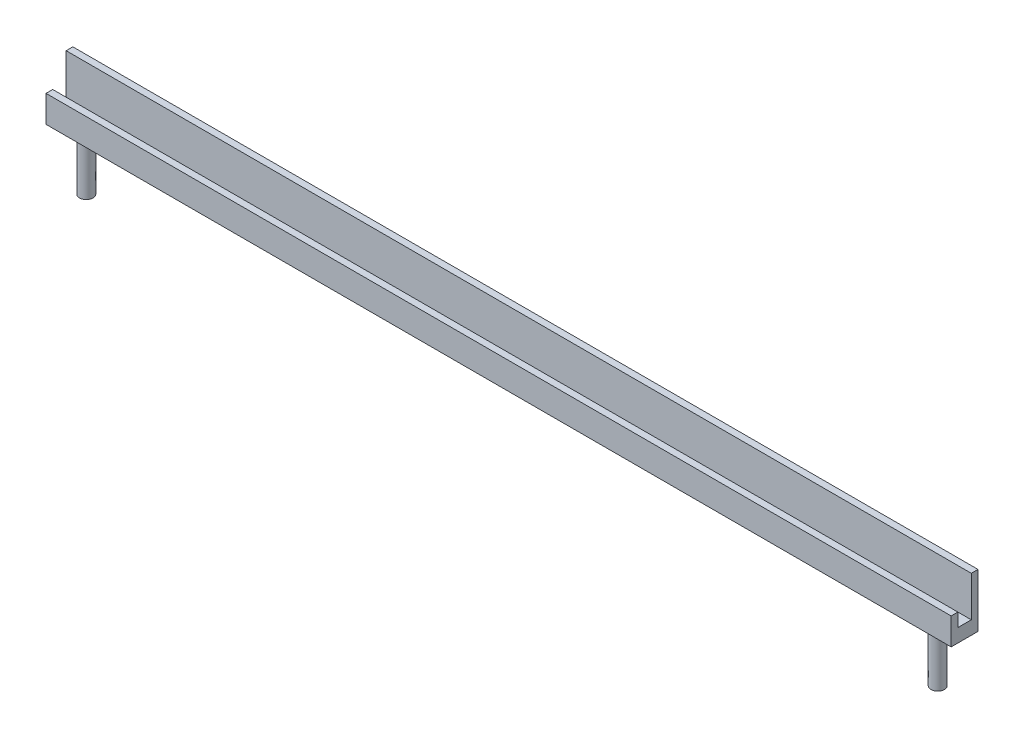
ISO-10303-21;
HEADER;
FILE_DESCRIPTION(('STEP AP214'),'2;1');
FILE_NAME('part.step','',(''),(''),'','','');
FILE_SCHEMA(('AUTOMOTIVE_DESIGN { 1 0 10303 214 1 1 1 1 }'));
ENDSEC;
DATA;
#1=APPLICATION_CONTEXT('core data for automotive mechanical design processes');
#2=APPLICATION_PROTOCOL_DEFINITION('international standard','automotive_design',2000,#1);
#3=PRODUCT_CONTEXT('',#1,'mechanical');
#4=PRODUCT('Part','Part','',(#3));
#5=PRODUCT_RELATED_PRODUCT_CATEGORY('part','',(#4));
#6=PRODUCT_DEFINITION_FORMATION('','',#4);
#7=PRODUCT_DEFINITION_CONTEXT('part definition',#1,'design');
#8=PRODUCT_DEFINITION('design','',#6,#7);
#9=PRODUCT_DEFINITION_SHAPE('','',#8);
#10=(LENGTH_UNIT() NAMED_UNIT(*) SI_UNIT(.MILLI.,.METRE.));
#11=(NAMED_UNIT(*) PLANE_ANGLE_UNIT() SI_UNIT($,.RADIAN.));
#12=(NAMED_UNIT(*) SI_UNIT($,.STERADIAN.) SOLID_ANGLE_UNIT());
#13=UNCERTAINTY_MEASURE_WITH_UNIT(LENGTH_MEASURE(1.E-05),#10,'distance_accuracy_value','');
#14=(GEOMETRIC_REPRESENTATION_CONTEXT(3) GLOBAL_UNCERTAINTY_ASSIGNED_CONTEXT((#13)) GLOBAL_UNIT_ASSIGNED_CONTEXT((#10,
#11,#12)) REPRESENTATION_CONTEXT('',''));
#15=CARTESIAN_POINT('',(0.,0.,0.));
#16=DIRECTION('',(0.,0.,1.));
#17=DIRECTION('',(1.,0.,0.));
#18=AXIS2_PLACEMENT_3D('',#15,#16,#17);
#19=CARTESIAN_POINT('',(0.,0.,0.));
#20=DIRECTION('',(0.,1.,0.));
#21=DIRECTION('',(0.,0.,1.));
#22=AXIS2_PLACEMENT_3D('',#19,#20,#21);
#23=PLANE('',#22);
#24=CARTESIAN_POINT('',(-158.5,0.,0.));
#25=DIRECTION('',(0.,1.,0.));
#26=DIRECTION('',(0.,0.,1.));
#27=AXIS2_PLACEMENT_3D('',#24,#25,#26);
#28=CIRCLE('',#27,2.5);
#29=CARTESIAN_POINT('',(-158.5,0.,2.5));
#30=VERTEX_POINT('',#29);
#31=EDGE_CURVE('E40',#30,#30,#28,.F.);
#32=ORIENTED_EDGE('',*,*,#31,.F.);
#33=EDGE_LOOP('',(#32));
#34=FACE_BOUND('',#33,.T.);
#35=DIRECTION('',(0.,0.,-1.));
#36=VECTOR('',#35,1.);
#37=CARTESIAN_POINT('',(168.5,0.,-5.));
#38=LINE('',#37,#36);
#39=CARTESIAN_POINT('',(168.5,0.,5.));
#40=VERTEX_POINT('',#39);
#41=CARTESIAN_POINT('',(168.5,0.,-5.));
#42=VERTEX_POINT('',#41);
#43=EDGE_CURVE('E151',#40,#42,#38,.T.);
#44=ORIENTED_EDGE('',*,*,#43,.F.);
#45=DIRECTION('',(1.,0.,0.));
#46=VECTOR('',#45,1.);
#47=CARTESIAN_POINT('',(-168.5,0.,5.));
#48=LINE('',#47,#46);
#49=CARTESIAN_POINT('',(-168.5,0.,5.));
#50=VERTEX_POINT('',#49);
#51=EDGE_CURVE('E163',#50,#40,#48,.T.);
#52=ORIENTED_EDGE('',*,*,#51,.F.);
#53=DIRECTION('',(0.,0.,1.));
#54=VECTOR('',#53,1.);
#55=CARTESIAN_POINT('',(-168.5,0.,-5.));
#56=LINE('',#55,#54);
#57=CARTESIAN_POINT('',(-168.5,0.,-5.));
#58=VERTEX_POINT('',#57);
#59=EDGE_CURVE('E161',#58,#50,#56,.T.);
#60=ORIENTED_EDGE('',*,*,#59,.F.);
#61=DIRECTION('',(-1.,0.,0.));
#62=VECTOR('',#61,1.);
#63=CARTESIAN_POINT('',(-168.5,0.,-5.));
#64=LINE('',#63,#62);
#65=EDGE_CURVE('E159',#42,#58,#64,.T.);
#66=ORIENTED_EDGE('',*,*,#65,.F.);
#67=EDGE_LOOP('',(#44,#52,#60,#66));
#68=FACE_BOUND('',#67,.T.);
#69=CARTESIAN_POINT('',(158.5,0.,0.));
#70=DIRECTION('',(0.,1.,0.));
#71=DIRECTION('',(0.,0.,1.));
#72=AXIS2_PLACEMENT_3D('',#69,#70,#71);
#73=CIRCLE('',#72,2.5);
#74=CARTESIAN_POINT('',(158.5,0.,2.5));
#75=VERTEX_POINT('',#74);
#76=EDGE_CURVE('E11',#75,#75,#73,.F.);
#77=ORIENTED_EDGE('',*,*,#76,.F.);
#78=EDGE_LOOP('',(#77));
#79=FACE_BOUND('',#78,.T.);
#80=ADVANCED_FACE('F32',(#34,#68,#79),#23,.F.);
#81=CARTESIAN_POINT('',(0.,5.,0.));
#82=DIRECTION('',(0.,1.,0.));
#83=DIRECTION('',(0.,0.,1.));
#84=AXIS2_PLACEMENT_3D('',#81,#82,#83);
#85=PLANE('',#84);
#86=DIRECTION('',(0.,0.,-1.));
#87=VECTOR('',#86,1.);
#88=CARTESIAN_POINT('',(168.5,5.,-5.));
#89=LINE('',#88,#87);
#90=CARTESIAN_POINT('',(168.5,5.,2.49999999999998));
#91=VERTEX_POINT('',#90);
#92=CARTESIAN_POINT('',(168.5,5.,-2.5));
#93=VERTEX_POINT('',#92);
#94=EDGE_CURVE('E52',#91,#93,#89,.T.);
#95=ORIENTED_EDGE('',*,*,#94,.T.);
#96=DIRECTION('',(1.,0.,0.));
#97=VECTOR('',#96,1.);
#98=CARTESIAN_POINT('',(-168.5,5.,-2.5));
#99=LINE('',#98,#97);
#100=CARTESIAN_POINT('',(-168.5,5.,-2.5));
#101=VERTEX_POINT('',#100);
#102=EDGE_CURVE('E47',#101,#93,#99,.T.);
#103=ORIENTED_EDGE('',*,*,#102,.F.);
#104=DIRECTION('',(0.,0.,1.));
#105=VECTOR('',#104,1.);
#106=CARTESIAN_POINT('',(-168.5,5.,-5.));
#107=LINE('',#106,#105);
#108=CARTESIAN_POINT('',(-168.5,5.,2.5));
#109=VERTEX_POINT('',#108);
#110=EDGE_CURVE('E118',#101,#109,#107,.T.);
#111=ORIENTED_EDGE('',*,*,#110,.T.);
#112=DIRECTION('',(-1.,0.,0.));
#113=VECTOR('',#112,1.);
#114=CARTESIAN_POINT('',(168.5,5.,2.49999999999996));
#115=LINE('',#114,#113);
#116=EDGE_CURVE('E119',#91,#109,#115,.T.);
#117=ORIENTED_EDGE('',*,*,#116,.F.);
#118=EDGE_LOOP('',(#95,#103,#111,#117));
#119=FACE_BOUND('',#118,.T.);
#120=ADVANCED_FACE('F181',(#119),#85,.T.);
#121=CARTESIAN_POINT('',(168.5,5.,-5.));
#122=DIRECTION('',(-1.,0.,0.));
#123=DIRECTION('',(0.,0.,1.));
#124=AXIS2_PLACEMENT_3D('',#121,#122,#123);
#125=PLANE('',#124);
#126=ORIENTED_EDGE('',*,*,#43,.T.);
#127=DIRECTION('',(0.,-1.,0.));
#128=VECTOR('',#127,1.);
#129=CARTESIAN_POINT('',(168.5,5.,-5.));
#130=LINE('',#129,#128);
#131=CARTESIAN_POINT('',(168.5,20.,-5.));
#132=VERTEX_POINT('',#131);
#133=EDGE_CURVE('E171',#132,#42,#130,.T.);
#134=ORIENTED_EDGE('',*,*,#133,.F.);
#135=DIRECTION('',(0.,0.,-1.));
#136=VECTOR('',#135,1.);
#137=CARTESIAN_POINT('',(168.5,20.,-2.5));
#138=LINE('',#137,#136);
#139=CARTESIAN_POINT('',(168.5,20.,-2.5));
#140=VERTEX_POINT('',#139);
#141=EDGE_CURVE('E105',#140,#132,#138,.T.);
#142=ORIENTED_EDGE('',*,*,#141,.F.);
#143=DIRECTION('',(0.,-1.,0.));
#144=VECTOR('',#143,1.);
#145=CARTESIAN_POINT('',(168.5,20.,-2.5));
#146=LINE('',#145,#144);
#147=EDGE_CURVE('E101',#140,#93,#146,.T.);
#148=ORIENTED_EDGE('',*,*,#147,.T.);
#149=ORIENTED_EDGE('',*,*,#94,.F.);
#150=DIRECTION('',(0.,-1.,0.));
#151=VECTOR('',#150,1.);
#152=CARTESIAN_POINT('',(168.5,10.,2.49999999999996));
#153=LINE('',#152,#151);
#154=CARTESIAN_POINT('',(168.5,10.,2.49999999999996));
#155=VERTEX_POINT('',#154);
#156=EDGE_CURVE('E146',#155,#91,#153,.T.);
#157=ORIENTED_EDGE('',*,*,#156,.F.);
#158=DIRECTION('',(0.,0.,-1.));
#159=VECTOR('',#158,1.);
#160=CARTESIAN_POINT('',(168.5,10.,2.49999999999996));
#161=LINE('',#160,#159);
#162=CARTESIAN_POINT('',(168.5,10.,5.));
#163=VERTEX_POINT('',#162);
#164=EDGE_CURVE('E122',#163,#155,#161,.T.);
#165=ORIENTED_EDGE('',*,*,#164,.F.);
#166=DIRECTION('',(0.,-1.,0.));
#167=VECTOR('',#166,1.);
#168=CARTESIAN_POINT('',(168.5,5.,5.));
#169=LINE('',#168,#167);
#170=EDGE_CURVE('E154',#163,#40,#169,.T.);
#171=ORIENTED_EDGE('',*,*,#170,.T.);
#172=EDGE_LOOP('',(#126,#134,#142,#148,#149,#157,#165,#171));
#173=FACE_BOUND('',#172,.T.);
#174=ADVANCED_FACE('F34',(#173),#125,.F.);
#175=CARTESIAN_POINT('',(-168.5,5.,-5.));
#176=DIRECTION('',(0.,0.,1.));
#177=DIRECTION('',(1.,0.,0.));
#178=AXIS2_PLACEMENT_3D('',#175,#176,#177);
#179=PLANE('',#178);
#180=ORIENTED_EDGE('',*,*,#65,.T.);
#181=DIRECTION('',(0.,-1.,0.));
#182=VECTOR('',#181,1.);
#183=CARTESIAN_POINT('',(-168.5,5.,-5.));
#184=LINE('',#183,#182);
#185=CARTESIAN_POINT('',(-168.5,20.,-5.));
#186=VERTEX_POINT('',#185);
#187=EDGE_CURVE('E170',#186,#58,#184,.T.);
#188=ORIENTED_EDGE('',*,*,#187,.F.);
#189=DIRECTION('',(-1.,0.,0.));
#190=VECTOR('',#189,1.);
#191=CARTESIAN_POINT('',(-168.5,20.,-5.));
#192=LINE('',#191,#190);
#193=EDGE_CURVE('E112',#132,#186,#192,.T.);
#194=ORIENTED_EDGE('',*,*,#193,.F.);
#195=ORIENTED_EDGE('',*,*,#133,.T.);
#196=EDGE_LOOP('',(#180,#188,#194,#195));
#197=FACE_BOUND('',#196,.T.);
#198=ADVANCED_FACE('F226',(#197),#179,.F.);
#199=CARTESIAN_POINT('',(-168.5,5.,-5.));
#200=DIRECTION('',(1.,0.,0.));
#201=DIRECTION('',(0.,0.,-1.));
#202=AXIS2_PLACEMENT_3D('',#199,#200,#201);
#203=PLANE('',#202);
#204=ORIENTED_EDGE('',*,*,#59,.T.);
#205=DIRECTION('',(0.,-1.,0.));
#206=VECTOR('',#205,1.);
#207=CARTESIAN_POINT('',(-168.5,5.,5.));
#208=LINE('',#207,#206);
#209=CARTESIAN_POINT('',(-168.5,10.,5.));
#210=VERTEX_POINT('',#209);
#211=EDGE_CURVE('E167',#210,#50,#208,.T.);
#212=ORIENTED_EDGE('',*,*,#211,.F.);
#213=DIRECTION('',(0.,0.,1.));
#214=VECTOR('',#213,1.);
#215=CARTESIAN_POINT('',(-168.5,10.,2.5));
#216=LINE('',#215,#214);
#217=CARTESIAN_POINT('',(-168.5,10.,2.5));
#218=VERTEX_POINT('',#217);
#219=EDGE_CURVE('E131',#218,#210,#216,.T.);
#220=ORIENTED_EDGE('',*,*,#219,.F.);
#221=DIRECTION('',(0.,-1.,0.));
#222=VECTOR('',#221,1.);
#223=CARTESIAN_POINT('',(-168.5,10.,2.5));
#224=LINE('',#223,#222);
#225=EDGE_CURVE('E137',#218,#109,#224,.T.);
#226=ORIENTED_EDGE('',*,*,#225,.T.);
#227=ORIENTED_EDGE('',*,*,#110,.F.);
#228=DIRECTION('',(0.,-1.,0.));
#229=VECTOR('',#228,1.);
#230=CARTESIAN_POINT('',(-168.5,20.,-2.5));
#231=LINE('',#230,#229);
#232=CARTESIAN_POINT('',(-168.5,20.,-2.5));
#233=VERTEX_POINT('',#232);
#234=EDGE_CURVE('E99',#233,#101,#231,.T.);
#235=ORIENTED_EDGE('',*,*,#234,.F.);
#236=DIRECTION('',(0.,0.,1.));
#237=VECTOR('',#236,1.);
#238=CARTESIAN_POINT('',(-168.5,20.,-2.5));
#239=LINE('',#238,#237);
#240=EDGE_CURVE('E106',#186,#233,#239,.T.);
#241=ORIENTED_EDGE('',*,*,#240,.F.);
#242=ORIENTED_EDGE('',*,*,#187,.T.);
#243=EDGE_LOOP('',(#204,#212,#220,#226,#227,#235,#241,#242));
#244=FACE_BOUND('',#243,.T.);
#245=ADVANCED_FACE('F116',(#244),#203,.F.);
#246=CARTESIAN_POINT('',(-168.5,5.,5.));
#247=DIRECTION('',(0.,0.,-1.));
#248=DIRECTION('',(-1.,0.,0.));
#249=AXIS2_PLACEMENT_3D('',#246,#247,#248);
#250=PLANE('',#249);
#251=ORIENTED_EDGE('',*,*,#51,.T.);
#252=ORIENTED_EDGE('',*,*,#170,.F.);
#253=DIRECTION('',(1.,0.,0.));
#254=VECTOR('',#253,1.);
#255=CARTESIAN_POINT('',(168.5,10.,5.));
#256=LINE('',#255,#254);
#257=EDGE_CURVE('E134',#210,#163,#256,.T.);
#258=ORIENTED_EDGE('',*,*,#257,.F.);
#259=ORIENTED_EDGE('',*,*,#211,.T.);
#260=EDGE_LOOP('',(#251,#252,#258,#259));
#261=FACE_BOUND('',#260,.T.);
#262=ADVANCED_FACE('F218',(#261),#250,.F.);
#263=CARTESIAN_POINT('',(168.5,10.,2.49999999999996));
#264=DIRECTION('',(0.,0.,1.));
#265=DIRECTION('',(1.,0.,0.));
#266=AXIS2_PLACEMENT_3D('',#263,#264,#265);
#267=PLANE('',#266);
#268=ORIENTED_EDGE('',*,*,#116,.T.);
#269=ORIENTED_EDGE('',*,*,#225,.F.);
#270=DIRECTION('',(-1.,0.,0.));
#271=VECTOR('',#270,1.);
#272=CARTESIAN_POINT('',(168.5,10.,2.49999999999996));
#273=LINE('',#272,#271);
#274=EDGE_CURVE('E129',#155,#218,#273,.T.);
#275=ORIENTED_EDGE('',*,*,#274,.F.);
#276=ORIENTED_EDGE('',*,*,#156,.T.);
#277=EDGE_LOOP('',(#268,#269,#275,#276));
#278=FACE_BOUND('',#277,.T.);
#279=ADVANCED_FACE('F214',(#278),#267,.F.);
#280=CARTESIAN_POINT('',(0.,10.,0.));
#281=DIRECTION('',(0.,-1.,0.));
#282=DIRECTION('',(0.,0.,-1.));
#283=AXIS2_PLACEMENT_3D('',#280,#281,#282);
#284=PLANE('',#283);
#285=ORIENTED_EDGE('',*,*,#164,.T.);
#286=ORIENTED_EDGE('',*,*,#274,.T.);
#287=ORIENTED_EDGE('',*,*,#219,.T.);
#288=ORIENTED_EDGE('',*,*,#257,.T.);
#289=EDGE_LOOP('',(#285,#286,#287,#288));
#290=FACE_BOUND('',#289,.T.);
#291=ADVANCED_FACE('F211',(#290),#284,.F.);
#292=CARTESIAN_POINT('',(-168.5,20.,-2.5));
#293=DIRECTION('',(0.,0.,-1.));
#294=DIRECTION('',(-1.,0.,0.));
#295=AXIS2_PLACEMENT_3D('',#292,#293,#294);
#296=PLANE('',#295);
#297=ORIENTED_EDGE('',*,*,#102,.T.);
#298=ORIENTED_EDGE('',*,*,#147,.F.);
#299=DIRECTION('',(1.,0.,0.));
#300=VECTOR('',#299,1.);
#301=CARTESIAN_POINT('',(-168.5,20.,-2.5));
#302=LINE('',#301,#300);
#303=EDGE_CURVE('E95',#233,#140,#302,.T.);
#304=ORIENTED_EDGE('',*,*,#303,.F.);
#305=ORIENTED_EDGE('',*,*,#234,.T.);
#306=EDGE_LOOP('',(#297,#298,#304,#305));
#307=FACE_BOUND('',#306,.T.);
#308=ADVANCED_FACE('F97',(#307),#296,.F.);
#309=CARTESIAN_POINT('',(0.,20.,0.));
#310=DIRECTION('',(0.,-1.,0.));
#311=DIRECTION('',(0.,0.,-1.));
#312=AXIS2_PLACEMENT_3D('',#309,#310,#311);
#313=PLANE('',#312);
#314=ORIENTED_EDGE('',*,*,#240,.T.);
#315=ORIENTED_EDGE('',*,*,#303,.T.);
#316=ORIENTED_EDGE('',*,*,#141,.T.);
#317=ORIENTED_EDGE('',*,*,#193,.T.);
#318=EDGE_LOOP('',(#314,#315,#316,#317));
#319=FACE_BOUND('',#318,.T.);
#320=ADVANCED_FACE('F110',(#319),#313,.F.);
#321=CARTESIAN_POINT('',(-158.5,-20.,0.));
#322=DIRECTION('',(0.,1.,0.));
#323=DIRECTION('',(0.,0.,1.));
#324=AXIS2_PLACEMENT_3D('',#321,#322,#323);
#325=CYLINDRICAL_SURFACE('',#324,2.5);
#326=CARTESIAN_POINT('',(-158.5,-20.,0.));
#327=DIRECTION('',(0.,-1.,0.));
#328=DIRECTION('',(0.,0.,-1.));
#329=AXIS2_PLACEMENT_3D('',#326,#327,#328);
#330=CIRCLE('',#329,2.5);
#331=CARTESIAN_POINT('',(-158.5,-20.,-2.5));
#332=VERTEX_POINT('',#331);
#333=EDGE_CURVE('E240',#332,#332,#330,.T.);
#334=ORIENTED_EDGE('',*,*,#333,.F.);
#335=EDGE_LOOP('',(#334));
#336=FACE_BOUND('',#335,.T.);
#337=ORIENTED_EDGE('',*,*,#31,.T.);
#338=EDGE_LOOP('',(#337));
#339=FACE_BOUND('',#338,.T.);
#340=ADVANCED_FACE('F177',(#336,#339),#325,.T.);
#341=CARTESIAN_POINT('',(-158.5,-20.,0.));
#342=DIRECTION('',(0.,-1.,0.));
#343=DIRECTION('',(0.,0.,-1.));
#344=AXIS2_PLACEMENT_3D('',#341,#342,#343);
#345=PLANE('',#344);
#346=ORIENTED_EDGE('',*,*,#333,.T.);
#347=EDGE_LOOP('',(#346));
#348=FACE_BOUND('',#347,.T.);
#349=ADVANCED_FACE('F191',(#348),#345,.T.);
#350=CARTESIAN_POINT('',(158.5,-20.,0.));
#351=DIRECTION('',(0.,1.,0.));
#352=DIRECTION('',(0.,0.,1.));
#353=AXIS2_PLACEMENT_3D('',#350,#351,#352);
#354=CYLINDRICAL_SURFACE('',#353,2.5);
#355=CARTESIAN_POINT('',(158.5,-20.,0.));
#356=DIRECTION('',(0.,-1.,0.));
#357=DIRECTION('',(0.,0.,-1.));
#358=AXIS2_PLACEMENT_3D('',#355,#356,#357);
#359=CIRCLE('',#358,2.5);
#360=CARTESIAN_POINT('',(158.5,-20.,-2.5));
#361=VERTEX_POINT('',#360);
#362=EDGE_CURVE('E242',#361,#361,#359,.T.);
#363=ORIENTED_EDGE('',*,*,#362,.F.);
#364=EDGE_LOOP('',(#363));
#365=FACE_BOUND('',#364,.T.);
#366=ORIENTED_EDGE('',*,*,#76,.T.);
#367=EDGE_LOOP('',(#366));
#368=FACE_BOUND('',#367,.T.);
#369=ADVANCED_FACE('F188',(#365,#368),#354,.T.);
#370=CARTESIAN_POINT('',(158.5,-20.,0.));
#371=DIRECTION('',(0.,-1.,0.));
#372=DIRECTION('',(0.,0.,-1.));
#373=AXIS2_PLACEMENT_3D('',#370,#371,#372);
#374=PLANE('',#373);
#375=ORIENTED_EDGE('',*,*,#362,.T.);
#376=EDGE_LOOP('',(#375));
#377=FACE_BOUND('',#376,.T.);
#378=ADVANCED_FACE('F190',(#377),#374,.T.);
#379=CLOSED_SHELL('',(#80,#120,#174,#198,#245,#262,#279,#291,#308,#320,#340,#349,#369,#378));
#380=MANIFOLD_SOLID_BREP('B2',#379);
#381=ADVANCED_BREP_SHAPE_REPRESENTATION('',(#18,#380),#14);
#382=SHAPE_DEFINITION_REPRESENTATION(#9,#381);
ENDSEC;
END-ISO-10303-21;
